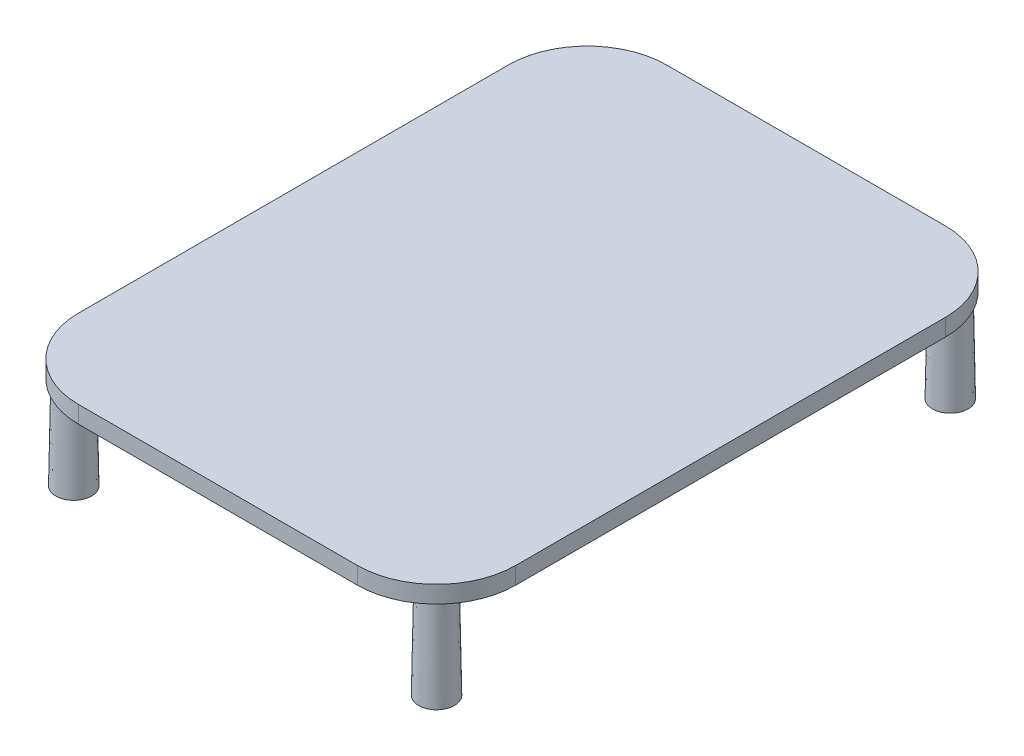
ISO-10303-21;
HEADER;
FILE_DESCRIPTION(('STEP AP214'),'2;1');
FILE_NAME('part.step','',(''),(''),'','','');
FILE_SCHEMA(('AUTOMOTIVE_DESIGN { 1 0 10303 214 1 1 1 1 }'));
ENDSEC;
DATA;
#1=APPLICATION_CONTEXT('core data for automotive mechanical design processes');
#2=APPLICATION_PROTOCOL_DEFINITION('international standard','automotive_design',2000,#1);
#3=PRODUCT_CONTEXT('',#1,'mechanical');
#4=PRODUCT('Part','Part','',(#3));
#5=PRODUCT_RELATED_PRODUCT_CATEGORY('part','',(#4));
#6=PRODUCT_DEFINITION_FORMATION('','',#4);
#7=PRODUCT_DEFINITION_CONTEXT('part definition',#1,'design');
#8=PRODUCT_DEFINITION('design','',#6,#7);
#9=PRODUCT_DEFINITION_SHAPE('','',#8);
#10=(LENGTH_UNIT() NAMED_UNIT(*) SI_UNIT(.MILLI.,.METRE.));
#11=(NAMED_UNIT(*) PLANE_ANGLE_UNIT() SI_UNIT($,.RADIAN.));
#12=(NAMED_UNIT(*) SI_UNIT($,.STERADIAN.) SOLID_ANGLE_UNIT());
#13=UNCERTAINTY_MEASURE_WITH_UNIT(LENGTH_MEASURE(1.E-05),#10,'distance_accuracy_value','');
#14=(GEOMETRIC_REPRESENTATION_CONTEXT(3) GLOBAL_UNCERTAINTY_ASSIGNED_CONTEXT((#13)) GLOBAL_UNIT_ASSIGNED_CONTEXT((#10,
#11,#12)) REPRESENTATION_CONTEXT('',''));
#15=CARTESIAN_POINT('',(0.,0.,0.));
#16=DIRECTION('',(0.,0.,1.));
#17=DIRECTION('',(1.,0.,0.));
#18=AXIS2_PLACEMENT_3D('',#15,#16,#17);
#19=CARTESIAN_POINT('',(-18.8245000572005,7.02631578947369,-28.7618188083454));
#20=DIRECTION('',(0.,1.,0.));
#21=DIRECTION('',(0.,0.,1.));
#22=AXIS2_PLACEMENT_3D('',#19,#20,#21);
#23=PLANE('',#22);
#24=DIRECTION('',(-1.,0.,0.));
#25=VECTOR('',#24,1.);
#26=CARTESIAN_POINT('',(-18.8245000572005,7.02631578947369,20.));
#27=LINE('',#26,#25);
#28=CARTESIAN_POINT('',(17.,7.02631578947369,20.));
#29=VERTEX_POINT('',#28);
#30=CARTESIAN_POINT('',(-17.,7.02631578947369,20.));
#31=VERTEX_POINT('',#30);
#32=EDGE_CURVE('E353',#29,#31,#27,.T.);
#33=ORIENTED_EDGE('',*,*,#32,.F.);
#34=DIRECTION('',(0.,0.,1.));
#35=VECTOR('',#34,1.);
#36=CARTESIAN_POINT('',(17.,7.02631578947369,-28.7618188083454));
#37=LINE('',#36,#35);
#38=CARTESIAN_POINT('',(17.,7.02631578947369,-20.));
#39=VERTEX_POINT('',#38);
#40=EDGE_CURVE('E58',#39,#29,#37,.T.);
#41=ORIENTED_EDGE('',*,*,#40,.F.);
#42=DIRECTION('',(1.,0.,0.));
#43=VECTOR('',#42,1.);
#44=CARTESIAN_POINT('',(-18.8245000572005,7.02631578947369,-20.));
#45=LINE('',#44,#43);
#46=CARTESIAN_POINT('',(-17.,7.02631578947369,-20.));
#47=VERTEX_POINT('',#46);
#48=EDGE_CURVE('E336',#47,#39,#45,.T.);
#49=ORIENTED_EDGE('',*,*,#48,.F.);
#50=DIRECTION('',(0.,0.,-1.));
#51=VECTOR('',#50,1.);
#52=CARTESIAN_POINT('',(-17.,7.02631578947369,-28.7618188083454));
#53=LINE('',#52,#51);
#54=EDGE_CURVE('E343',#31,#47,#53,.T.);
#55=ORIENTED_EDGE('',*,*,#54,.F.);
#56=EDGE_LOOP('',(#33,#41,#49,#55));
#57=FACE_BOUND('',#56,.T.);
#58=CARTESIAN_POINT('',(-15.6245000572005,7.02631578947369,-22.1245000572005));
#59=DIRECTION('',(0.,1.,0.));
#60=DIRECTION('',(0.,0.,1.));
#61=AXIS2_PLACEMENT_3D('',#58,#59,#60);
#62=CIRCLE('',#61,1.4);
#63=CARTESIAN_POINT('',(-15.6245000572005,7.02631578947369,-20.7245000572005));
#64=VERTEX_POINT('',#63);
#65=EDGE_CURVE('E11',#64,#64,#62,.F.);
#66=ORIENTED_EDGE('',*,*,#65,.F.);
#67=EDGE_LOOP('',(#66));
#68=FACE_BOUND('',#67,.T.);
#69=CARTESIAN_POINT('',(15.6245000572005,7.02631578947369,-22.1245000572005));
#70=DIRECTION('',(0.,1.,0.));
#71=DIRECTION('',(0.,0.,1.));
#72=AXIS2_PLACEMENT_3D('',#69,#70,#71);
#73=CIRCLE('',#72,1.4);
#74=CARTESIAN_POINT('',(15.6245000572005,7.02631578947369,-20.7245000572005));
#75=VERTEX_POINT('',#74);
#76=EDGE_CURVE('E51',#75,#75,#73,.F.);
#77=ORIENTED_EDGE('',*,*,#76,.F.);
#78=EDGE_LOOP('',(#77));
#79=FACE_BOUND('',#78,.T.);
#80=CARTESIAN_POINT('',(15.6245000572005,7.02631578947369,22.1245000572005));
#81=DIRECTION('',(0.,1.,0.));
#82=DIRECTION('',(0.,0.,1.));
#83=AXIS2_PLACEMENT_3D('',#80,#81,#82);
#84=CIRCLE('',#83,1.4);
#85=CARTESIAN_POINT('',(15.6245000572005,7.02631578947369,23.5245000572005));
#86=VERTEX_POINT('',#85);
#87=EDGE_CURVE('E225',#86,#86,#84,.F.);
#88=ORIENTED_EDGE('',*,*,#87,.F.);
#89=EDGE_LOOP('',(#88));
#90=FACE_BOUND('',#89,.T.);
#91=CARTESIAN_POINT('',(-15.6245000572005,7.02631578947369,22.1245000572005));
#92=DIRECTION('',(0.,1.,0.));
#93=DIRECTION('',(0.,0.,1.));
#94=AXIS2_PLACEMENT_3D('',#91,#92,#93);
#95=CIRCLE('',#94,1.4);
#96=CARTESIAN_POINT('',(-15.6245000572005,7.02631578947369,23.5245000572005));
#97=VERTEX_POINT('',#96);
#98=EDGE_CURVE('E221',#97,#97,#95,.F.);
#99=ORIENTED_EDGE('',*,*,#98,.F.);
#100=EDGE_LOOP('',(#99));
#101=FACE_BOUND('',#100,.T.);
#102=CARTESIAN_POINT('',(12.005,7.02631578947369,-18.505));
#103=DIRECTION('',(0.,1.,0.));
#104=DIRECTION('',(0.,0.,1.));
#105=AXIS2_PLACEMENT_3D('',#102,#103,#104);
#106=CIRCLE('',#105,6.82);
#107=CARTESIAN_POINT('',(18.825,7.02631578947369,-18.505));
#108=VERTEX_POINT('',#107);
#109=CARTESIAN_POINT('',(12.0049999999999,7.02631578947369,-25.325));
#110=VERTEX_POINT('',#109);
#111=EDGE_CURVE('E187',#108,#110,#106,.T.);
#112=ORIENTED_EDGE('',*,*,#111,.F.);
#113=DIRECTION('',(0.,0.,1.));
#114=VECTOR('',#113,1.);
#115=CARTESIAN_POINT('',(18.825,7.02631578947369,-18.5));
#116=LINE('',#115,#114);
#117=CARTESIAN_POINT('',(18.825,7.02631578947369,18.5049999999999));
#118=VERTEX_POINT('',#117);
#119=EDGE_CURVE('E149',#108,#118,#116,.T.);
#120=ORIENTED_EDGE('',*,*,#119,.T.);
#121=CARTESIAN_POINT('',(12.005,7.02631578947369,18.505));
#122=DIRECTION('',(0.,1.,0.));
#123=DIRECTION('',(0.,0.,1.));
#124=AXIS2_PLACEMENT_3D('',#121,#122,#123);
#125=CIRCLE('',#124,6.82);
#126=CARTESIAN_POINT('',(12.005,7.02631578947369,25.325));
#127=VERTEX_POINT('',#126);
#128=EDGE_CURVE('E131',#127,#118,#125,.T.);
#129=ORIENTED_EDGE('',*,*,#128,.F.);
#130=DIRECTION('',(-1.,0.,0.));
#131=VECTOR('',#130,1.);
#132=CARTESIAN_POINT('',(-12.,7.02631578947369,25.325));
#133=LINE('',#132,#131);
#134=CARTESIAN_POINT('',(-12.005,7.02631578947369,25.325));
#135=VERTEX_POINT('',#134);
#136=EDGE_CURVE('E142',#127,#135,#133,.T.);
#137=ORIENTED_EDGE('',*,*,#136,.T.);
#138=CARTESIAN_POINT('',(-12.005,7.02631578947369,18.505));
#139=DIRECTION('',(0.,1.,0.));
#140=DIRECTION('',(0.,0.,1.));
#141=AXIS2_PLACEMENT_3D('',#138,#139,#140);
#142=CIRCLE('',#141,6.82);
#143=CARTESIAN_POINT('',(-18.825,7.02631578947369,18.505));
#144=VERTEX_POINT('',#143);
#145=EDGE_CURVE('E147',#144,#135,#142,.T.);
#146=ORIENTED_EDGE('',*,*,#145,.F.);
#147=DIRECTION('',(0.,0.,-1.));
#148=VECTOR('',#147,1.);
#149=CARTESIAN_POINT('',(-18.825,7.02631578947369,-18.5));
#150=LINE('',#149,#148);
#151=CARTESIAN_POINT('',(-18.825,7.02631578947369,-18.505));
#152=VERTEX_POINT('',#151);
#153=EDGE_CURVE('E380',#144,#152,#150,.T.);
#154=ORIENTED_EDGE('',*,*,#153,.T.);
#155=CARTESIAN_POINT('',(-12.005,7.02631578947369,-18.505));
#156=DIRECTION('',(0.,1.,0.));
#157=DIRECTION('',(0.,0.,1.));
#158=AXIS2_PLACEMENT_3D('',#155,#156,#157);
#159=CIRCLE('',#158,6.82);
#160=CARTESIAN_POINT('',(-12.005,7.02631578947369,-25.325));
#161=VERTEX_POINT('',#160);
#162=EDGE_CURVE('E376',#161,#152,#159,.T.);
#163=ORIENTED_EDGE('',*,*,#162,.F.);
#164=DIRECTION('',(1.,0.,0.));
#165=VECTOR('',#164,1.);
#166=CARTESIAN_POINT('',(-12.,7.02631578947369,-25.325));
#167=LINE('',#166,#165);
#168=EDGE_CURVE('E107',#161,#110,#167,.T.);
#169=ORIENTED_EDGE('',*,*,#168,.T.);
#170=EDGE_LOOP('',(#112,#120,#129,#137,#146,#154,#163,#169));
#171=FACE_BOUND('',#170,.T.);
#172=ADVANCED_FACE('F42',(#57,#68,#79,#90,#101,#171),#23,.F.);
#173=CARTESIAN_POINT('',(-15.6245000572005,7.02631578947369,22.1245000572005));
#174=DIRECTION('',(0.,-1.,0.));
#175=DIRECTION('',(0.,0.,-1.));
#176=AXIS2_PLACEMENT_3D('',#173,#174,#175);
#177=CONICAL_SURFACE('',#176,1.4,0.0174532925199433);
#178=CARTESIAN_POINT('',(-15.6245000572005,-0.973684210526312,22.1245000572005));
#179=DIRECTION('',(0.,-1.,0.));
#180=DIRECTION('',(0.,0.,-1.));
#181=AXIS2_PLACEMENT_3D('',#178,#179,#180);
#182=CIRCLE('',#181,1.53964051942574);
#183=CARTESIAN_POINT('',(-15.6245000572005,-0.973684210526312,20.5848595377747));
#184=VERTEX_POINT('',#183);
#185=EDGE_CURVE('E217',#184,#184,#182,.T.);
#186=ORIENTED_EDGE('',*,*,#185,.F.);
#187=EDGE_LOOP('',(#186));
#188=FACE_BOUND('',#187,.T.);
#189=ORIENTED_EDGE('',*,*,#98,.T.);
#190=EDGE_LOOP('',(#189));
#191=FACE_BOUND('',#190,.T.);
#192=ADVANCED_FACE('F236',(#188,#191),#177,.T.);
#193=CARTESIAN_POINT('',(-15.6245000572005,-0.973684210526312,22.1245000572005));
#194=DIRECTION('',(0.,-1.,0.));
#195=DIRECTION('',(0.,0.,-1.));
#196=AXIS2_PLACEMENT_3D('',#193,#194,#195);
#197=PLANE('',#196);
#198=ORIENTED_EDGE('',*,*,#185,.T.);
#199=EDGE_LOOP('',(#198));
#200=FACE_BOUND('',#199,.T.);
#201=ADVANCED_FACE('F243',(#200),#197,.T.);
#202=CARTESIAN_POINT('',(15.6245000572005,7.02631578947369,22.1245000572005));
#203=DIRECTION('',(0.,-1.,0.));
#204=DIRECTION('',(0.,0.,-1.));
#205=AXIS2_PLACEMENT_3D('',#202,#203,#204);
#206=CONICAL_SURFACE('',#205,1.4,0.0174532925199433);
#207=CARTESIAN_POINT('',(15.6245000572005,-0.973684210526312,22.1245000572005));
#208=DIRECTION('',(0.,-1.,0.));
#209=DIRECTION('',(0.,0.,-1.));
#210=AXIS2_PLACEMENT_3D('',#207,#208,#209);
#211=CIRCLE('',#210,1.53964051942574);
#212=CARTESIAN_POINT('',(15.6245000572005,-0.973684210526312,20.5848595377747));
#213=VERTEX_POINT('',#212);
#214=EDGE_CURVE('E213',#213,#213,#211,.T.);
#215=ORIENTED_EDGE('',*,*,#214,.F.);
#216=EDGE_LOOP('',(#215));
#217=FACE_BOUND('',#216,.T.);
#218=ORIENTED_EDGE('',*,*,#87,.T.);
#219=EDGE_LOOP('',(#218));
#220=FACE_BOUND('',#219,.T.);
#221=ADVANCED_FACE('F249',(#217,#220),#206,.T.);
#222=CARTESIAN_POINT('',(15.6245000572005,-0.973684210526312,22.1245000572005));
#223=DIRECTION('',(0.,-1.,0.));
#224=DIRECTION('',(0.,0.,-1.));
#225=AXIS2_PLACEMENT_3D('',#222,#223,#224);
#226=PLANE('',#225);
#227=ORIENTED_EDGE('',*,*,#214,.T.);
#228=EDGE_LOOP('',(#227));
#229=FACE_BOUND('',#228,.T.);
#230=ADVANCED_FACE('F254',(#229),#226,.T.);
#231=CARTESIAN_POINT('',(15.6245000572005,7.02631578947369,-22.1245000572005));
#232=DIRECTION('',(0.,-1.,0.));
#233=DIRECTION('',(0.,0.,-1.));
#234=AXIS2_PLACEMENT_3D('',#231,#232,#233);
#235=CONICAL_SURFACE('',#234,1.4,0.0174532925199433);
#236=CARTESIAN_POINT('',(15.6245000572005,-0.973684210526312,-22.1245000572005));
#237=DIRECTION('',(0.,-1.,0.));
#238=DIRECTION('',(0.,0.,-1.));
#239=AXIS2_PLACEMENT_3D('',#236,#237,#238);
#240=CIRCLE('',#239,1.53964051942574);
#241=CARTESIAN_POINT('',(15.6245000572005,-0.973684210526312,-23.6641405766262));
#242=VERTEX_POINT('',#241);
#243=EDGE_CURVE('E209',#242,#242,#240,.T.);
#244=ORIENTED_EDGE('',*,*,#243,.F.);
#245=EDGE_LOOP('',(#244));
#246=FACE_BOUND('',#245,.T.);
#247=ORIENTED_EDGE('',*,*,#76,.T.);
#248=EDGE_LOOP('',(#247));
#249=FACE_BOUND('',#248,.T.);
#250=ADVANCED_FACE('F232',(#246,#249),#235,.T.);
#251=CARTESIAN_POINT('',(15.6245000572005,-0.973684210526312,-22.1245000572005));
#252=DIRECTION('',(0.,-1.,0.));
#253=DIRECTION('',(0.,0.,-1.));
#254=AXIS2_PLACEMENT_3D('',#251,#252,#253);
#255=PLANE('',#254);
#256=ORIENTED_EDGE('',*,*,#243,.T.);
#257=EDGE_LOOP('',(#256));
#258=FACE_BOUND('',#257,.T.);
#259=ADVANCED_FACE('F261',(#258),#255,.T.);
#260=CARTESIAN_POINT('',(-15.6245000572005,7.02631578947369,-22.1245000572005));
#261=DIRECTION('',(0.,-1.,0.));
#262=DIRECTION('',(0.,0.,-1.));
#263=AXIS2_PLACEMENT_3D('',#260,#261,#262);
#264=CONICAL_SURFACE('',#263,1.4,0.0174532925199433);
#265=CARTESIAN_POINT('',(-15.6245000572005,-0.973684210526312,-22.1245000572005));
#266=DIRECTION('',(0.,-1.,0.));
#267=DIRECTION('',(0.,0.,-1.));
#268=AXIS2_PLACEMENT_3D('',#265,#266,#267);
#269=CIRCLE('',#268,1.53964051942574);
#270=CARTESIAN_POINT('',(-15.6245000572005,-0.973684210526312,-23.6641405766262));
#271=VERTEX_POINT('',#270);
#272=EDGE_CURVE('E190',#271,#271,#269,.T.);
#273=ORIENTED_EDGE('',*,*,#272,.F.);
#274=EDGE_LOOP('',(#273));
#275=FACE_BOUND('',#274,.T.);
#276=ORIENTED_EDGE('',*,*,#65,.T.);
#277=EDGE_LOOP('',(#276));
#278=FACE_BOUND('',#277,.T.);
#279=ADVANCED_FACE('F264',(#275,#278),#264,.T.);
#280=CARTESIAN_POINT('',(-15.6245000572005,-0.973684210526312,-22.1245000572005));
#281=DIRECTION('',(0.,-1.,0.));
#282=DIRECTION('',(0.,0.,-1.));
#283=AXIS2_PLACEMENT_3D('',#280,#281,#282);
#284=PLANE('',#283);
#285=ORIENTED_EDGE('',*,*,#272,.T.);
#286=EDGE_LOOP('',(#285));
#287=FACE_BOUND('',#286,.T.);
#288=ADVANCED_FACE('F269',(#287),#284,.T.);
#289=CARTESIAN_POINT('',(12.005,7.02631578947369,-18.505));
#290=DIRECTION('',(0.,1.,0.));
#291=DIRECTION('',(0.,0.,1.));
#292=AXIS2_PLACEMENT_3D('',#289,#290,#291);
#293=CYLINDRICAL_SURFACE('',#292,6.82);
#294=CARTESIAN_POINT('',(12.005,8.5,-18.505));
#295=DIRECTION('',(0.,1.,0.));
#296=DIRECTION('',(0.,0.,1.));
#297=AXIS2_PLACEMENT_3D('',#294,#295,#296);
#298=CIRCLE('',#297,6.82);
#299=CARTESIAN_POINT('',(18.825,8.5,-18.505));
#300=VERTEX_POINT('',#299);
#301=CARTESIAN_POINT('',(12.0049999999999,8.5,-25.325));
#302=VERTEX_POINT('',#301);
#303=EDGE_CURVE('E158',#300,#302,#298,.T.);
#304=ORIENTED_EDGE('',*,*,#303,.F.);
#305=DIRECTION('',(0.,1.,0.));
#306=VECTOR('',#305,1.);
#307=CARTESIAN_POINT('',(18.825,7.02631578947369,-18.505));
#308=LINE('',#307,#306);
#309=EDGE_CURVE('E67',#108,#300,#308,.T.);
#310=ORIENTED_EDGE('',*,*,#309,.F.);
#311=ORIENTED_EDGE('',*,*,#111,.T.);
#312=DIRECTION('',(0.,1.,0.));
#313=VECTOR('',#312,1.);
#314=CARTESIAN_POINT('',(12.0049999999999,7.02631578947369,-25.325));
#315=LINE('',#314,#313);
#316=EDGE_CURVE('E154',#110,#302,#315,.T.);
#317=ORIENTED_EDGE('',*,*,#316,.T.);
#318=EDGE_LOOP('',(#304,#310,#311,#317));
#319=FACE_BOUND('',#318,.T.);
#320=ADVANCED_FACE('F272',(#319),#293,.T.);
#321=CARTESIAN_POINT('',(18.825,7.02631578947369,-18.5));
#322=DIRECTION('',(-1.,0.,0.));
#323=DIRECTION('',(0.,0.,1.));
#324=AXIS2_PLACEMENT_3D('',#321,#322,#323);
#325=PLANE('',#324);
#326=DIRECTION('',(0.,0.,1.));
#327=VECTOR('',#326,1.);
#328=CARTESIAN_POINT('',(18.825,8.5,-18.5));
#329=LINE('',#328,#327);
#330=CARTESIAN_POINT('',(18.825,8.5,18.5049999999999));
#331=VERTEX_POINT('',#330);
#332=EDGE_CURVE('E184',#300,#331,#329,.T.);
#333=ORIENTED_EDGE('',*,*,#332,.T.);
#334=DIRECTION('',(0.,1.,0.));
#335=VECTOR('',#334,1.);
#336=CARTESIAN_POINT('',(18.825,7.02631578947369,18.5049999999999));
#337=LINE('',#336,#335);
#338=EDGE_CURVE('E138',#118,#331,#337,.T.);
#339=ORIENTED_EDGE('',*,*,#338,.F.);
#340=ORIENTED_EDGE('',*,*,#119,.F.);
#341=ORIENTED_EDGE('',*,*,#309,.T.);
#342=EDGE_LOOP('',(#333,#339,#340,#341));
#343=FACE_BOUND('',#342,.T.);
#344=ADVANCED_FACE('F279',(#343),#325,.F.);
#345=CARTESIAN_POINT('',(12.005,7.02631578947369,18.505));
#346=DIRECTION('',(0.,1.,0.));
#347=DIRECTION('',(0.,0.,1.));
#348=AXIS2_PLACEMENT_3D('',#345,#346,#347);
#349=CYLINDRICAL_SURFACE('',#348,6.82);
#350=CARTESIAN_POINT('',(12.005,8.5,18.505));
#351=DIRECTION('',(0.,1.,0.));
#352=DIRECTION('',(0.,0.,1.));
#353=AXIS2_PLACEMENT_3D('',#350,#351,#352);
#354=CIRCLE('',#353,6.82);
#355=CARTESIAN_POINT('',(12.005,8.5,25.325));
#356=VERTEX_POINT('',#355);
#357=EDGE_CURVE('E133',#356,#331,#354,.T.);
#358=ORIENTED_EDGE('',*,*,#357,.F.);
#359=DIRECTION('',(0.,1.,0.));
#360=VECTOR('',#359,1.);
#361=CARTESIAN_POINT('',(12.005,7.02631578947369,25.325));
#362=LINE('',#361,#360);
#363=EDGE_CURVE('E127',#127,#356,#362,.T.);
#364=ORIENTED_EDGE('',*,*,#363,.F.);
#365=ORIENTED_EDGE('',*,*,#128,.T.);
#366=ORIENTED_EDGE('',*,*,#338,.T.);
#367=EDGE_LOOP('',(#358,#364,#365,#366));
#368=FACE_BOUND('',#367,.T.);
#369=ADVANCED_FACE('F129',(#368),#349,.T.);
#370=CARTESIAN_POINT('',(-12.,7.02631578947369,25.325));
#371=DIRECTION('',(0.,0.,-1.));
#372=DIRECTION('',(-1.,0.,0.));
#373=AXIS2_PLACEMENT_3D('',#370,#371,#372);
#374=PLANE('',#373);
#375=DIRECTION('',(-1.,0.,0.));
#376=VECTOR('',#375,1.);
#377=CARTESIAN_POINT('',(-12.,8.5,25.325));
#378=LINE('',#377,#376);
#379=CARTESIAN_POINT('',(-12.005,8.5,25.325));
#380=VERTEX_POINT('',#379);
#381=EDGE_CURVE('E179',#356,#380,#378,.T.);
#382=ORIENTED_EDGE('',*,*,#381,.T.);
#383=DIRECTION('',(0.,1.,0.));
#384=VECTOR('',#383,1.);
#385=CARTESIAN_POINT('',(-12.005,7.02631578947369,25.325));
#386=LINE('',#385,#384);
#387=EDGE_CURVE('E139',#135,#380,#386,.T.);
#388=ORIENTED_EDGE('',*,*,#387,.F.);
#389=ORIENTED_EDGE('',*,*,#136,.F.);
#390=ORIENTED_EDGE('',*,*,#363,.T.);
#391=EDGE_LOOP('',(#382,#388,#389,#390));
#392=FACE_BOUND('',#391,.T.);
#393=ADVANCED_FACE('F143',(#392),#374,.F.);
#394=CARTESIAN_POINT('',(-12.005,7.02631578947369,18.505));
#395=DIRECTION('',(0.,1.,0.));
#396=DIRECTION('',(0.,0.,1.));
#397=AXIS2_PLACEMENT_3D('',#394,#395,#396);
#398=CYLINDRICAL_SURFACE('',#397,6.82);
#399=CARTESIAN_POINT('',(-12.005,8.5,18.505));
#400=DIRECTION('',(0.,1.,0.));
#401=DIRECTION('',(0.,0.,1.));
#402=AXIS2_PLACEMENT_3D('',#399,#400,#401);
#403=CIRCLE('',#402,6.82);
#404=CARTESIAN_POINT('',(-18.825,8.5,18.505));
#405=VERTEX_POINT('',#404);
#406=EDGE_CURVE('E175',#405,#380,#403,.T.);
#407=ORIENTED_EDGE('',*,*,#406,.F.);
#408=DIRECTION('',(0.,1.,0.));
#409=VECTOR('',#408,1.);
#410=CARTESIAN_POINT('',(-18.825,7.02631578947369,18.505));
#411=LINE('',#410,#409);
#412=EDGE_CURVE('E195',#144,#405,#411,.T.);
#413=ORIENTED_EDGE('',*,*,#412,.F.);
#414=ORIENTED_EDGE('',*,*,#145,.T.);
#415=ORIENTED_EDGE('',*,*,#387,.T.);
#416=EDGE_LOOP('',(#407,#413,#414,#415));
#417=FACE_BOUND('',#416,.T.);
#418=ADVANCED_FACE('F291',(#417),#398,.T.);
#419=CARTESIAN_POINT('',(-18.825,7.02631578947369,-18.5));
#420=DIRECTION('',(1.,0.,0.));
#421=DIRECTION('',(0.,0.,-1.));
#422=AXIS2_PLACEMENT_3D('',#419,#420,#421);
#423=PLANE('',#422);
#424=DIRECTION('',(0.,0.,-1.));
#425=VECTOR('',#424,1.);
#426=CARTESIAN_POINT('',(-18.825,8.5,-18.5));
#427=LINE('',#426,#425);
#428=CARTESIAN_POINT('',(-18.825,8.5,-18.505));
#429=VERTEX_POINT('',#428);
#430=EDGE_CURVE('E171',#405,#429,#427,.T.);
#431=ORIENTED_EDGE('',*,*,#430,.T.);
#432=DIRECTION('',(0.,1.,0.));
#433=VECTOR('',#432,1.);
#434=CARTESIAN_POINT('',(-18.825,7.02631578947369,-18.505));
#435=LINE('',#434,#433);
#436=EDGE_CURVE('E198',#152,#429,#435,.T.);
#437=ORIENTED_EDGE('',*,*,#436,.F.);
#438=ORIENTED_EDGE('',*,*,#153,.F.);
#439=ORIENTED_EDGE('',*,*,#412,.T.);
#440=EDGE_LOOP('',(#431,#437,#438,#439));
#441=FACE_BOUND('',#440,.T.);
#442=ADVANCED_FACE('F287',(#441),#423,.F.);
#443=CARTESIAN_POINT('',(-12.005,7.02631578947369,-18.505));
#444=DIRECTION('',(0.,1.,0.));
#445=DIRECTION('',(0.,0.,1.));
#446=AXIS2_PLACEMENT_3D('',#443,#444,#445);
#447=CYLINDRICAL_SURFACE('',#446,6.82);
#448=CARTESIAN_POINT('',(-12.005,8.5,-18.505));
#449=DIRECTION('',(0.,1.,0.));
#450=DIRECTION('',(0.,0.,1.));
#451=AXIS2_PLACEMENT_3D('',#448,#449,#450);
#452=CIRCLE('',#451,6.82);
#453=CARTESIAN_POINT('',(-12.005,8.5,-25.325));
#454=VERTEX_POINT('',#453);
#455=EDGE_CURVE('E167',#454,#429,#452,.T.);
#456=ORIENTED_EDGE('',*,*,#455,.F.);
#457=DIRECTION('',(0.,1.,0.));
#458=VECTOR('',#457,1.);
#459=CARTESIAN_POINT('',(-12.005,7.02631578947369,-25.325));
#460=LINE('',#459,#458);
#461=EDGE_CURVE('E201',#161,#454,#460,.T.);
#462=ORIENTED_EDGE('',*,*,#461,.F.);
#463=ORIENTED_EDGE('',*,*,#162,.T.);
#464=ORIENTED_EDGE('',*,*,#436,.T.);
#465=EDGE_LOOP('',(#456,#462,#463,#464));
#466=FACE_BOUND('',#465,.T.);
#467=ADVANCED_FACE('F283',(#466),#447,.T.);
#468=CARTESIAN_POINT('',(-12.,7.02631578947369,-25.325));
#469=DIRECTION('',(0.,0.,1.));
#470=DIRECTION('',(1.,0.,0.));
#471=AXIS2_PLACEMENT_3D('',#468,#469,#470);
#472=PLANE('',#471);
#473=DIRECTION('',(1.,0.,0.));
#474=VECTOR('',#473,1.);
#475=CARTESIAN_POINT('',(-12.,8.5,-25.325));
#476=LINE('',#475,#474);
#477=EDGE_CURVE('E162',#454,#302,#476,.T.);
#478=ORIENTED_EDGE('',*,*,#477,.T.);
#479=ORIENTED_EDGE('',*,*,#316,.F.);
#480=ORIENTED_EDGE('',*,*,#168,.F.);
#481=ORIENTED_EDGE('',*,*,#461,.T.);
#482=EDGE_LOOP('',(#478,#479,#480,#481));
#483=FACE_BOUND('',#482,.T.);
#484=ADVANCED_FACE('F280',(#483),#472,.F.);
#485=CARTESIAN_POINT('',(-12.,8.5,-18.5));
#486=DIRECTION('',(0.,1.,0.));
#487=DIRECTION('',(0.,0.,1.));
#488=AXIS2_PLACEMENT_3D('',#485,#486,#487);
#489=PLANE('',#488);
#490=ORIENTED_EDGE('',*,*,#303,.T.);
#491=ORIENTED_EDGE('',*,*,#477,.F.);
#492=ORIENTED_EDGE('',*,*,#455,.T.);
#493=ORIENTED_EDGE('',*,*,#430,.F.);
#494=ORIENTED_EDGE('',*,*,#406,.T.);
#495=ORIENTED_EDGE('',*,*,#381,.F.);
#496=ORIENTED_EDGE('',*,*,#357,.T.);
#497=ORIENTED_EDGE('',*,*,#332,.F.);
#498=EDGE_LOOP('',(#490,#491,#492,#493,#494,#495,#496,#497));
#499=FACE_BOUND('',#498,.T.);
#500=ADVANCED_FACE('F44',(#499),#489,.T.);
#501=CARTESIAN_POINT('',(17.,7.52631578947369,-28.7618188083454));
#502=DIRECTION('',(1.,0.,0.));
#503=DIRECTION('',(0.,0.,-1.));
#504=AXIS2_PLACEMENT_3D('',#501,#502,#503);
#505=PLANE('',#504);
#506=ORIENTED_EDGE('',*,*,#40,.T.);
#507=DIRECTION('',(0.,-1.,0.));
#508=VECTOR('',#507,1.);
#509=CARTESIAN_POINT('',(17.,7.52631578947369,20.));
#510=LINE('',#509,#508);
#511=CARTESIAN_POINT('',(17.,7.52631578947369,20.));
#512=VERTEX_POINT('',#511);
#513=EDGE_CURVE('E350',#512,#29,#510,.T.);
#514=ORIENTED_EDGE('',*,*,#513,.F.);
#515=DIRECTION('',(0.,0.,1.));
#516=VECTOR('',#515,1.);
#517=CARTESIAN_POINT('',(17.,7.52631578947369,-28.7618188083454));
#518=LINE('',#517,#516);
#519=CARTESIAN_POINT('',(17.,7.52631578947369,-20.));
#520=VERTEX_POINT('',#519);
#521=EDGE_CURVE('E327',#520,#512,#518,.T.);
#522=ORIENTED_EDGE('',*,*,#521,.F.);
#523=DIRECTION('',(0.,-1.,0.));
#524=VECTOR('',#523,1.);
#525=CARTESIAN_POINT('',(17.,7.52631578947369,-20.));
#526=LINE('',#525,#524);
#527=EDGE_CURVE('E163',#520,#39,#526,.T.);
#528=ORIENTED_EDGE('',*,*,#527,.T.);
#529=EDGE_LOOP('',(#506,#514,#522,#528));
#530=FACE_BOUND('',#529,.T.);
#531=ADVANCED_FACE('F302',(#530),#505,.F.);
#532=CARTESIAN_POINT('',(-18.8245000572005,7.52631578947369,-20.));
#533=DIRECTION('',(0.,0.,-1.));
#534=DIRECTION('',(-1.,0.,0.));
#535=AXIS2_PLACEMENT_3D('',#532,#533,#534);
#536=PLANE('',#535);
#537=ORIENTED_EDGE('',*,*,#48,.T.);
#538=ORIENTED_EDGE('',*,*,#527,.F.);
#539=DIRECTION('',(1.,0.,0.));
#540=VECTOR('',#539,1.);
#541=CARTESIAN_POINT('',(-18.8245000572005,7.52631578947369,-20.));
#542=LINE('',#541,#540);
#543=CARTESIAN_POINT('',(-17.,7.52631578947369,-20.));
#544=VERTEX_POINT('',#543);
#545=EDGE_CURVE('E333',#544,#520,#542,.T.);
#546=ORIENTED_EDGE('',*,*,#545,.F.);
#547=DIRECTION('',(0.,-1.,0.));
#548=VECTOR('',#547,1.);
#549=CARTESIAN_POINT('',(-17.,7.52631578947369,-20.));
#550=LINE('',#549,#548);
#551=EDGE_CURVE('E362',#544,#47,#550,.T.);
#552=ORIENTED_EDGE('',*,*,#551,.T.);
#553=EDGE_LOOP('',(#537,#538,#546,#552));
#554=FACE_BOUND('',#553,.T.);
#555=ADVANCED_FACE('F305',(#554),#536,.F.);
#556=CARTESIAN_POINT('',(-17.,7.52631578947369,-28.7618188083454));
#557=DIRECTION('',(-1.,0.,0.));
#558=DIRECTION('',(0.,0.,1.));
#559=AXIS2_PLACEMENT_3D('',#556,#557,#558);
#560=PLANE('',#559);
#561=ORIENTED_EDGE('',*,*,#54,.T.);
#562=ORIENTED_EDGE('',*,*,#551,.F.);
#563=DIRECTION('',(0.,0.,-1.));
#564=VECTOR('',#563,1.);
#565=CARTESIAN_POINT('',(-17.,7.52631578947369,-28.7618188083454));
#566=LINE('',#565,#564);
#567=CARTESIAN_POINT('',(-17.,7.52631578947369,20.));
#568=VERTEX_POINT('',#567);
#569=EDGE_CURVE('E340',#568,#544,#566,.T.);
#570=ORIENTED_EDGE('',*,*,#569,.F.);
#571=DIRECTION('',(0.,-1.,0.));
#572=VECTOR('',#571,1.);
#573=CARTESIAN_POINT('',(-17.,7.52631578947369,20.));
#574=LINE('',#573,#572);
#575=EDGE_CURVE('E366',#568,#31,#574,.T.);
#576=ORIENTED_EDGE('',*,*,#575,.T.);
#577=EDGE_LOOP('',(#561,#562,#570,#576));
#578=FACE_BOUND('',#577,.T.);
#579=ADVANCED_FACE('F310',(#578),#560,.F.);
#580=CARTESIAN_POINT('',(-18.8245000572005,7.52631578947369,20.));
#581=DIRECTION('',(0.,0.,1.));
#582=DIRECTION('',(1.,0.,0.));
#583=AXIS2_PLACEMENT_3D('',#580,#581,#582);
#584=PLANE('',#583);
#585=ORIENTED_EDGE('',*,*,#32,.T.);
#586=ORIENTED_EDGE('',*,*,#575,.F.);
#587=DIRECTION('',(-1.,0.,0.));
#588=VECTOR('',#587,1.);
#589=CARTESIAN_POINT('',(-18.8245000572005,7.52631578947369,20.));
#590=LINE('',#589,#588);
#591=EDGE_CURVE('E331',#512,#568,#590,.T.);
#592=ORIENTED_EDGE('',*,*,#591,.F.);
#593=ORIENTED_EDGE('',*,*,#513,.T.);
#594=EDGE_LOOP('',(#585,#586,#592,#593));
#595=FACE_BOUND('',#594,.T.);
#596=ADVANCED_FACE('F306',(#595),#584,.F.);
#597=CARTESIAN_POINT('',(0.,7.52631578947369,0.));
#598=DIRECTION('',(0.,-1.,0.));
#599=DIRECTION('',(0.,0.,-1.));
#600=AXIS2_PLACEMENT_3D('',#597,#598,#599);
#601=PLANE('',#600);
#602=ORIENTED_EDGE('',*,*,#521,.T.);
#603=ORIENTED_EDGE('',*,*,#591,.T.);
#604=ORIENTED_EDGE('',*,*,#569,.T.);
#605=ORIENTED_EDGE('',*,*,#545,.T.);
#606=EDGE_LOOP('',(#602,#603,#604,#605));
#607=FACE_BOUND('',#606,.T.);
#608=ADVANCED_FACE('F309',(#607),#601,.T.);
#609=CLOSED_SHELL('',(#172,#192,#201,#221,#230,#250,#259,#279,#288,#320,#344,#369,#393,#418,
#442,#467,#484,#500,#531,#555,#579,#596,#608));
#610=MANIFOLD_SOLID_BREP('B2',#609);
#611=ADVANCED_BREP_SHAPE_REPRESENTATION('',(#18,#610),#14);
#612=SHAPE_DEFINITION_REPRESENTATION(#9,#611);
ENDSEC;
END-ISO-10303-21;
